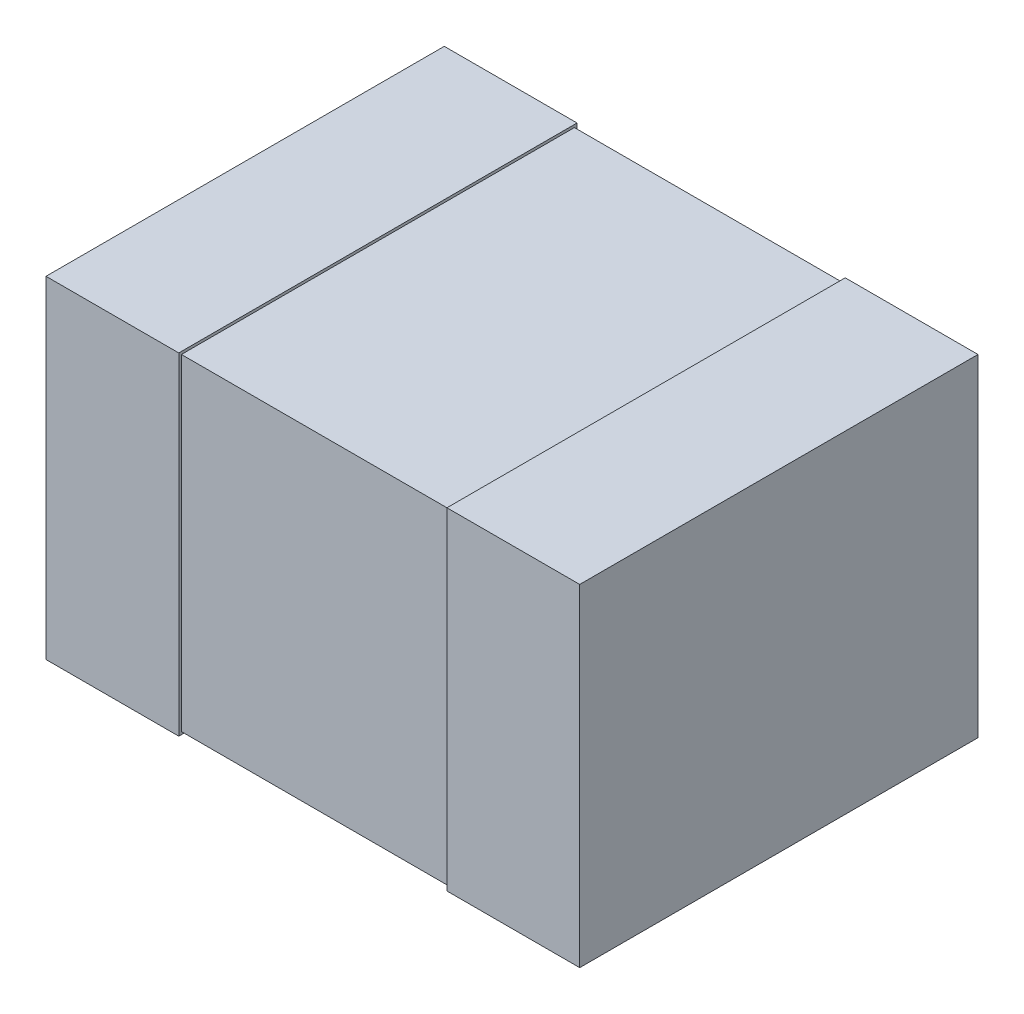
ISO-10303-21;
HEADER;
FILE_DESCRIPTION(('STEP AP214'),'2;1');
FILE_NAME('part.step','',(''),(''),'','','');
FILE_SCHEMA(('AUTOMOTIVE_DESIGN { 1 0 10303 214 1 1 1 1 }'));
ENDSEC;
DATA;
#1=APPLICATION_CONTEXT('core data for automotive mechanical design processes');
#2=APPLICATION_PROTOCOL_DEFINITION('international standard','automotive_design',2000,#1);
#3=PRODUCT_CONTEXT('',#1,'mechanical');
#4=PRODUCT('Part','Part','',(#3));
#5=PRODUCT_RELATED_PRODUCT_CATEGORY('part','',(#4));
#6=PRODUCT_DEFINITION_FORMATION('','',#4);
#7=PRODUCT_DEFINITION_CONTEXT('part definition',#1,'design');
#8=PRODUCT_DEFINITION('design','',#6,#7);
#9=PRODUCT_DEFINITION_SHAPE('','',#8);
#10=(LENGTH_UNIT() NAMED_UNIT(*) SI_UNIT(.MILLI.,.METRE.));
#11=(NAMED_UNIT(*) PLANE_ANGLE_UNIT() SI_UNIT($,.RADIAN.));
#12=(NAMED_UNIT(*) SI_UNIT($,.STERADIAN.) SOLID_ANGLE_UNIT());
#13=UNCERTAINTY_MEASURE_WITH_UNIT(LENGTH_MEASURE(1.E-05),#10,'distance_accuracy_value','');
#14=(GEOMETRIC_REPRESENTATION_CONTEXT(3) GLOBAL_UNCERTAINTY_ASSIGNED_CONTEXT((#13)) GLOBAL_UNIT_ASSIGNED_CONTEXT((#10,
#11,#12)) REPRESENTATION_CONTEXT('',''));
#15=CARTESIAN_POINT('',(0.,0.,0.));
#16=DIRECTION('',(0.,0.,1.));
#17=DIRECTION('',(1.,0.,0.));
#18=AXIS2_PLACEMENT_3D('',#15,#16,#17);
#19=CARTESIAN_POINT('',(1.005,-0.625,0.0762));
#20=DIRECTION('',(1.,0.,0.));
#21=DIRECTION('',(0.,0.,-1.));
#22=AXIS2_PLACEMENT_3D('',#19,#20,#21);
#23=PLANE('',#22);
#24=DIRECTION('',(0.,0.,-1.));
#25=VECTOR('',#24,1.);
#26=CARTESIAN_POINT('',(1.005,-0.625,0.0762));
#27=LINE('',#26,#25);
#28=CARTESIAN_POINT('',(1.005,-0.625,0.0762));
#29=VERTEX_POINT('',#28);
#30=CARTESIAN_POINT('',(1.005,-0.625,1.5762));
#31=VERTEX_POINT('',#30);
#32=EDGE_CURVE('E109',#29,#31,#27,.F.);
#33=ORIENTED_EDGE('',*,*,#32,.F.);
#34=DIRECTION('',(0.,1.,0.));
#35=VECTOR('',#34,1.);
#36=CARTESIAN_POINT('',(1.005,0.,0.0762));
#37=LINE('',#36,#35);
#38=CARTESIAN_POINT('',(1.005,0.625,0.0762));
#39=VERTEX_POINT('',#38);
#40=EDGE_CURVE('E20',#29,#39,#37,.T.);
#41=ORIENTED_EDGE('',*,*,#40,.T.);
#42=DIRECTION('',(0.,0.,1.));
#43=VECTOR('',#42,1.);
#44=CARTESIAN_POINT('',(1.005,0.625,0.0762));
#45=LINE('',#44,#43);
#46=CARTESIAN_POINT('',(1.005,0.625,1.5762));
#47=VERTEX_POINT('',#46);
#48=EDGE_CURVE('E104',#47,#39,#45,.F.);
#49=ORIENTED_EDGE('',*,*,#48,.F.);
#50=DIRECTION('',(0.,1.,0.));
#51=VECTOR('',#50,1.);
#52=CARTESIAN_POINT('',(1.005,0.,1.5762));
#53=LINE('',#52,#51);
#54=EDGE_CURVE('E119',#31,#47,#53,.T.);
#55=ORIENTED_EDGE('',*,*,#54,.F.);
#56=EDGE_LOOP('',(#33,#41,#49,#55));
#57=FACE_BOUND('',#56,.T.);
#58=ADVANCED_FACE('F17',(#57),#23,.T.);
#59=CARTESIAN_POINT('',(0.,0.,0.0762));
#60=DIRECTION('',(0.,0.,1.));
#61=DIRECTION('',(1.,0.,0.));
#62=AXIS2_PLACEMENT_3D('',#59,#60,#61);
#63=PLANE('',#62);
#64=ORIENTED_EDGE('',*,*,#40,.F.);
#65=DIRECTION('',(1.,0.,0.));
#66=VECTOR('',#65,1.);
#67=CARTESIAN_POINT('',(-1.005,-0.625,0.0762));
#68=LINE('',#67,#66);
#69=CARTESIAN_POINT('',(0.505,-0.625,0.0762));
#70=VERTEX_POINT('',#69);
#71=EDGE_CURVE('E128',#70,#29,#68,.T.);
#72=ORIENTED_EDGE('',*,*,#71,.F.);
#73=DIRECTION('',(0.,1.,0.));
#74=VECTOR('',#73,1.);
#75=CARTESIAN_POINT('',(0.505,-0.625,0.0762));
#76=LINE('',#75,#74);
#77=CARTESIAN_POINT('',(0.505,0.625,0.0762));
#78=VERTEX_POINT('',#77);
#79=EDGE_CURVE('E116',#70,#78,#76,.T.);
#80=ORIENTED_EDGE('',*,*,#79,.T.);
#81=DIRECTION('',(1.,0.,0.));
#82=VECTOR('',#81,1.);
#83=CARTESIAN_POINT('',(1.005,0.625,0.0762));
#84=LINE('',#83,#82);
#85=EDGE_CURVE('E113',#39,#78,#84,.F.);
#86=ORIENTED_EDGE('',*,*,#85,.F.);
#87=EDGE_LOOP('',(#64,#72,#80,#86));
#88=FACE_BOUND('',#87,.T.);
#89=ADVANCED_FACE('F114',(#88),#63,.F.);
#90=CARTESIAN_POINT('',(1.005,0.625,0.0762));
#91=DIRECTION('',(0.,1.,0.));
#92=DIRECTION('',(0.,0.,1.));
#93=AXIS2_PLACEMENT_3D('',#90,#91,#92);
#94=PLANE('',#93);
#95=ORIENTED_EDGE('',*,*,#85,.T.);
#96=DIRECTION('',(0.,0.,-1.));
#97=VECTOR('',#96,1.);
#98=CARTESIAN_POINT('',(0.505,0.625,0.0862));
#99=LINE('',#98,#97);
#100=CARTESIAN_POINT('',(0.505,0.625,1.5762));
#101=VERTEX_POINT('',#100);
#102=EDGE_CURVE('E135',#78,#101,#99,.F.);
#103=ORIENTED_EDGE('',*,*,#102,.T.);
#104=DIRECTION('',(1.,0.,0.));
#105=VECTOR('',#104,1.);
#106=CARTESIAN_POINT('',(0.,0.625,1.5762));
#107=LINE('',#106,#105);
#108=EDGE_CURVE('E123',#47,#101,#107,.F.);
#109=ORIENTED_EDGE('',*,*,#108,.F.);
#110=ORIENTED_EDGE('',*,*,#48,.T.);
#111=EDGE_LOOP('',(#95,#103,#109,#110));
#112=FACE_BOUND('',#111,.T.);
#113=ADVANCED_FACE('F121',(#112),#94,.T.);
#114=CARTESIAN_POINT('',(0.,0.,1.5762));
#115=DIRECTION('',(0.,0.,1.));
#116=DIRECTION('',(1.,0.,0.));
#117=AXIS2_PLACEMENT_3D('',#114,#115,#116);
#118=PLANE('',#117);
#119=ORIENTED_EDGE('',*,*,#108,.T.);
#120=DIRECTION('',(0.,1.,0.));
#121=VECTOR('',#120,1.);
#122=CARTESIAN_POINT('',(0.505,-0.625,1.5762));
#123=LINE('',#122,#121);
#124=CARTESIAN_POINT('',(0.505,-0.625,1.5762));
#125=VERTEX_POINT('',#124);
#126=EDGE_CURVE('E137',#101,#125,#123,.F.);
#127=ORIENTED_EDGE('',*,*,#126,.T.);
#128=DIRECTION('',(1.,0.,0.));
#129=VECTOR('',#128,1.);
#130=CARTESIAN_POINT('',(-1.005,-0.625,1.5762));
#131=LINE('',#130,#129);
#132=EDGE_CURVE('E131',#31,#125,#131,.F.);
#133=ORIENTED_EDGE('',*,*,#132,.F.);
#134=ORIENTED_EDGE('',*,*,#54,.T.);
#135=EDGE_LOOP('',(#119,#127,#133,#134));
#136=FACE_BOUND('',#135,.T.);
#137=ADVANCED_FACE('F324',(#136),#118,.T.);
#138=CARTESIAN_POINT('',(-1.005,-0.625,0.0762));
#139=DIRECTION('',(0.,-1.,0.));
#140=DIRECTION('',(0.,0.,-1.));
#141=AXIS2_PLACEMENT_3D('',#138,#139,#140);
#142=PLANE('',#141);
#143=ORIENTED_EDGE('',*,*,#132,.T.);
#144=DIRECTION('',(0.,0.,-1.));
#145=VECTOR('',#144,1.);
#146=CARTESIAN_POINT('',(0.505,-0.625,0.0862));
#147=LINE('',#146,#145);
#148=EDGE_CURVE('E139',#125,#70,#147,.T.);
#149=ORIENTED_EDGE('',*,*,#148,.T.);
#150=ORIENTED_EDGE('',*,*,#71,.T.);
#151=ORIENTED_EDGE('',*,*,#32,.T.);
#152=EDGE_LOOP('',(#143,#149,#150,#151));
#153=FACE_BOUND('',#152,.T.);
#154=ADVANCED_FACE('F315',(#153),#142,.T.);
#155=CARTESIAN_POINT('',(0.505,-0.625,0.0862));
#156=DIRECTION('',(1.,0.,0.));
#157=DIRECTION('',(0.,0.,-1.));
#158=AXIS2_PLACEMENT_3D('',#155,#156,#157);
#159=PLANE('',#158);
#160=DIRECTION('',(0.,1.,0.));
#161=VECTOR('',#160,1.);
#162=CARTESIAN_POINT('',(0.505,0.625,1.5662));
#163=LINE('',#162,#161);
#164=CARTESIAN_POINT('',(0.505,0.615,1.5662));
#165=VERTEX_POINT('',#164);
#166=CARTESIAN_POINT('',(0.505,-0.615,1.5662));
#167=VERTEX_POINT('',#166);
#168=EDGE_CURVE('E157',#165,#167,#163,.F.);
#169=ORIENTED_EDGE('',*,*,#168,.T.);
#170=DIRECTION('',(0.,0.,1.));
#171=VECTOR('',#170,1.);
#172=CARTESIAN_POINT('',(0.505,-0.615,1.5762));
#173=LINE('',#172,#171);
#174=CARTESIAN_POINT('',(0.505,-0.615,0.0862));
#175=VERTEX_POINT('',#174);
#176=EDGE_CURVE('E142',#167,#175,#173,.F.);
#177=ORIENTED_EDGE('',*,*,#176,.T.);
#178=DIRECTION('',(0.,1.,0.));
#179=VECTOR('',#178,1.);
#180=CARTESIAN_POINT('',(0.505,-0.625,0.0862));
#181=LINE('',#180,#179);
#182=CARTESIAN_POINT('',(0.505,0.615,0.0862));
#183=VERTEX_POINT('',#182);
#184=EDGE_CURVE('E147',#175,#183,#181,.T.);
#185=ORIENTED_EDGE('',*,*,#184,.T.);
#186=DIRECTION('',(0.,0.,-1.));
#187=VECTOR('',#186,1.);
#188=CARTESIAN_POINT('',(0.505,0.615,0.0762));
#189=LINE('',#188,#187);
#190=EDGE_CURVE('E152',#183,#165,#189,.F.);
#191=ORIENTED_EDGE('',*,*,#190,.T.);
#192=EDGE_LOOP('',(#169,#177,#185,#191));
#193=FACE_BOUND('',#192,.T.);
#194=ORIENTED_EDGE('',*,*,#126,.F.);
#195=ORIENTED_EDGE('',*,*,#102,.F.);
#196=ORIENTED_EDGE('',*,*,#79,.F.);
#197=ORIENTED_EDGE('',*,*,#148,.F.);
#198=EDGE_LOOP('',(#194,#195,#196,#197));
#199=FACE_BOUND('',#198,.T.);
#200=ADVANCED_FACE('F305',(#193,#199),#159,.F.);
#201=CARTESIAN_POINT('',(-0.505,-0.615,1.5762));
#202=DIRECTION('',(0.,1.,0.));
#203=DIRECTION('',(0.,0.,1.));
#204=AXIS2_PLACEMENT_3D('',#201,#202,#203);
#205=PLANE('',#204);
#206=DIRECTION('',(1.,0.,0.));
#207=VECTOR('',#206,1.);
#208=CARTESIAN_POINT('',(-0.505,-0.615,0.0862));
#209=LINE('',#208,#207);
#210=CARTESIAN_POINT('',(-0.505,-0.615,0.0862));
#211=VERTEX_POINT('',#210);
#212=EDGE_CURVE('E144',#211,#175,#209,.T.);
#213=ORIENTED_EDGE('',*,*,#212,.T.);
#214=ORIENTED_EDGE('',*,*,#176,.F.);
#215=DIRECTION('',(-1.,0.,0.));
#216=VECTOR('',#215,1.);
#217=CARTESIAN_POINT('',(-0.505,-0.615,1.5662));
#218=LINE('',#217,#216);
#219=CARTESIAN_POINT('',(-0.505,-0.615,1.5662));
#220=VERTEX_POINT('',#219);
#221=EDGE_CURVE('E159',#167,#220,#218,.T.);
#222=ORIENTED_EDGE('',*,*,#221,.T.);
#223=DIRECTION('',(0.,0.,1.));
#224=VECTOR('',#223,1.);
#225=CARTESIAN_POINT('',(-0.505,-0.615,0.0762));
#226=LINE('',#225,#224);
#227=EDGE_CURVE('E161',#220,#211,#226,.F.);
#228=ORIENTED_EDGE('',*,*,#227,.T.);
#229=EDGE_LOOP('',(#213,#214,#222,#228));
#230=FACE_BOUND('',#229,.T.);
#231=ADVANCED_FACE('F295',(#230),#205,.F.);
#232=CARTESIAN_POINT('',(-0.505,-0.625,0.0862));
#233=DIRECTION('',(0.,0.,1.));
#234=DIRECTION('',(1.,0.,0.));
#235=AXIS2_PLACEMENT_3D('',#232,#233,#234);
#236=PLANE('',#235);
#237=DIRECTION('',(1.,0.,0.));
#238=VECTOR('',#237,1.);
#239=CARTESIAN_POINT('',(-0.505,0.615,0.0862));
#240=LINE('',#239,#238);
#241=CARTESIAN_POINT('',(-0.505,0.615,0.0862));
#242=VERTEX_POINT('',#241);
#243=EDGE_CURVE('E149',#242,#183,#240,.T.);
#244=ORIENTED_EDGE('',*,*,#243,.T.);
#245=ORIENTED_EDGE('',*,*,#184,.F.);
#246=ORIENTED_EDGE('',*,*,#212,.F.);
#247=DIRECTION('',(0.,1.,0.));
#248=VECTOR('',#247,1.);
#249=CARTESIAN_POINT('',(-0.505,-0.625,0.0862));
#250=LINE('',#249,#248);
#251=EDGE_CURVE('E163',#211,#242,#250,.T.);
#252=ORIENTED_EDGE('',*,*,#251,.T.);
#253=EDGE_LOOP('',(#244,#245,#246,#252));
#254=FACE_BOUND('',#253,.T.);
#255=ADVANCED_FACE('F285',(#254),#236,.F.);
#256=CARTESIAN_POINT('',(-0.505,0.615,0.0762));
#257=DIRECTION('',(0.,-1.,0.));
#258=DIRECTION('',(0.,0.,-1.));
#259=AXIS2_PLACEMENT_3D('',#256,#257,#258);
#260=PLANE('',#259);
#261=DIRECTION('',(-1.,0.,0.));
#262=VECTOR('',#261,1.);
#263=CARTESIAN_POINT('',(-0.505,0.615,1.5662));
#264=LINE('',#263,#262);
#265=CARTESIAN_POINT('',(-0.505,0.615,1.5662));
#266=VERTEX_POINT('',#265);
#267=EDGE_CURVE('E154',#266,#165,#264,.F.);
#268=ORIENTED_EDGE('',*,*,#267,.T.);
#269=ORIENTED_EDGE('',*,*,#190,.F.);
#270=ORIENTED_EDGE('',*,*,#243,.F.);
#271=DIRECTION('',(0.,0.,1.));
#272=VECTOR('',#271,1.);
#273=CARTESIAN_POINT('',(-0.505,0.615,0.0762));
#274=LINE('',#273,#272);
#275=EDGE_CURVE('E165',#242,#266,#274,.T.);
#276=ORIENTED_EDGE('',*,*,#275,.T.);
#277=EDGE_LOOP('',(#268,#269,#270,#276));
#278=FACE_BOUND('',#277,.T.);
#279=ADVANCED_FACE('F275',(#278),#260,.F.);
#280=CARTESIAN_POINT('',(-0.505,0.625,1.5662));
#281=DIRECTION('',(0.,0.,-1.));
#282=DIRECTION('',(-1.,0.,0.));
#283=AXIS2_PLACEMENT_3D('',#280,#281,#282);
#284=PLANE('',#283);
#285=ORIENTED_EDGE('',*,*,#221,.F.);
#286=ORIENTED_EDGE('',*,*,#168,.F.);
#287=ORIENTED_EDGE('',*,*,#267,.F.);
#288=DIRECTION('',(0.,1.,0.));
#289=VECTOR('',#288,1.);
#290=CARTESIAN_POINT('',(-0.505,-0.625,1.5662));
#291=LINE('',#290,#289);
#292=EDGE_CURVE('E167',#266,#220,#291,.F.);
#293=ORIENTED_EDGE('',*,*,#292,.T.);
#294=EDGE_LOOP('',(#285,#286,#287,#293));
#295=FACE_BOUND('',#294,.T.);
#296=ADVANCED_FACE('F219',(#295),#284,.F.);
#297=CARTESIAN_POINT('',(-0.505,-0.625,0.0762));
#298=DIRECTION('',(-1.,0.,0.));
#299=DIRECTION('',(0.,0.,1.));
#300=AXIS2_PLACEMENT_3D('',#297,#298,#299);
#301=PLANE('',#300);
#302=ORIENTED_EDGE('',*,*,#275,.F.);
#303=ORIENTED_EDGE('',*,*,#251,.F.);
#304=ORIENTED_EDGE('',*,*,#227,.F.);
#305=ORIENTED_EDGE('',*,*,#292,.F.);
#306=EDGE_LOOP('',(#302,#303,#304,#305));
#307=FACE_BOUND('',#306,.T.);
#308=DIRECTION('',(0.,1.,0.));
#309=VECTOR('',#308,1.);
#310=CARTESIAN_POINT('',(-0.505,0.,1.5762));
#311=LINE('',#310,#309);
#312=CARTESIAN_POINT('',(-0.505,-0.625,1.5762));
#313=VERTEX_POINT('',#312);
#314=CARTESIAN_POINT('',(-0.505,0.625,1.5762));
#315=VERTEX_POINT('',#314);
#316=EDGE_CURVE('E175',#313,#315,#311,.T.);
#317=ORIENTED_EDGE('',*,*,#316,.F.);
#318=DIRECTION('',(0.,0.,-1.));
#319=VECTOR('',#318,1.);
#320=CARTESIAN_POINT('',(-0.505,-0.625,0.0762));
#321=LINE('',#320,#319);
#322=CARTESIAN_POINT('',(-0.505,-0.625,0.0762));
#323=VERTEX_POINT('',#322);
#324=EDGE_CURVE('E170',#323,#313,#321,.F.);
#325=ORIENTED_EDGE('',*,*,#324,.F.);
#326=DIRECTION('',(0.,1.,0.));
#327=VECTOR('',#326,1.);
#328=CARTESIAN_POINT('',(-0.505,0.,0.0762));
#329=LINE('',#328,#327);
#330=CARTESIAN_POINT('',(-0.505,0.625,0.0762));
#331=VERTEX_POINT('',#330);
#332=EDGE_CURVE('E182',#323,#331,#329,.T.);
#333=ORIENTED_EDGE('',*,*,#332,.T.);
#334=DIRECTION('',(0.,0.,1.));
#335=VECTOR('',#334,1.);
#336=CARTESIAN_POINT('',(-0.505,0.625,0.0762));
#337=LINE('',#336,#335);
#338=EDGE_CURVE('E180',#315,#331,#337,.F.);
#339=ORIENTED_EDGE('',*,*,#338,.F.);
#340=EDGE_LOOP('',(#317,#325,#333,#339));
#341=FACE_BOUND('',#340,.T.);
#342=ADVANCED_FACE('F204',(#307,#341),#301,.F.);
#343=CARTESIAN_POINT('',(-1.005,-0.625,0.0762));
#344=DIRECTION('',(0.,-1.,0.));
#345=DIRECTION('',(0.,0.,-1.));
#346=AXIS2_PLACEMENT_3D('',#343,#344,#345);
#347=PLANE('',#346);
#348=DIRECTION('',(1.,0.,0.));
#349=VECTOR('',#348,1.);
#350=CARTESIAN_POINT('',(0.,-0.625,0.0762));
#351=LINE('',#350,#349);
#352=CARTESIAN_POINT('',(-1.005,-0.625,0.0762));
#353=VERTEX_POINT('',#352);
#354=EDGE_CURVE('E185',#353,#323,#351,.T.);
#355=ORIENTED_EDGE('',*,*,#354,.T.);
#356=ORIENTED_EDGE('',*,*,#324,.T.);
#357=DIRECTION('',(1.,0.,0.));
#358=VECTOR('',#357,1.);
#359=CARTESIAN_POINT('',(0.,-0.625,1.5762));
#360=LINE('',#359,#358);
#361=CARTESIAN_POINT('',(-1.005,-0.625,1.5762));
#362=VERTEX_POINT('',#361);
#363=EDGE_CURVE('E172',#362,#313,#360,.T.);
#364=ORIENTED_EDGE('',*,*,#363,.F.);
#365=DIRECTION('',(0.,0.,1.));
#366=VECTOR('',#365,1.);
#367=CARTESIAN_POINT('',(-1.005,-0.625,0.0762));
#368=LINE('',#367,#366);
#369=EDGE_CURVE('E188',#353,#362,#368,.T.);
#370=ORIENTED_EDGE('',*,*,#369,.F.);
#371=EDGE_LOOP('',(#355,#356,#364,#370));
#372=FACE_BOUND('',#371,.T.);
#373=ADVANCED_FACE('F210',(#372),#347,.T.);
#374=CARTESIAN_POINT('',(0.,0.,1.5762));
#375=DIRECTION('',(0.,0.,1.));
#376=DIRECTION('',(1.,0.,0.));
#377=AXIS2_PLACEMENT_3D('',#374,#375,#376);
#378=PLANE('',#377);
#379=ORIENTED_EDGE('',*,*,#363,.T.);
#380=ORIENTED_EDGE('',*,*,#316,.T.);
#381=DIRECTION('',(1.,0.,0.));
#382=VECTOR('',#381,1.);
#383=CARTESIAN_POINT('',(1.005,0.625,1.5762));
#384=LINE('',#383,#382);
#385=CARTESIAN_POINT('',(-1.005,0.625,1.5762));
#386=VERTEX_POINT('',#385);
#387=EDGE_CURVE('E177',#386,#315,#384,.T.);
#388=ORIENTED_EDGE('',*,*,#387,.F.);
#389=DIRECTION('',(0.,1.,0.));
#390=VECTOR('',#389,1.);
#391=CARTESIAN_POINT('',(-1.005,0.625,1.5762));
#392=LINE('',#391,#390);
#393=EDGE_CURVE('E191',#362,#386,#392,.T.);
#394=ORIENTED_EDGE('',*,*,#393,.F.);
#395=EDGE_LOOP('',(#379,#380,#388,#394));
#396=FACE_BOUND('',#395,.T.);
#397=ADVANCED_FACE('F201',(#396),#378,.T.);
#398=CARTESIAN_POINT('',(1.005,0.625,0.0762));
#399=DIRECTION('',(0.,1.,0.));
#400=DIRECTION('',(0.,0.,1.));
#401=AXIS2_PLACEMENT_3D('',#398,#399,#400);
#402=PLANE('',#401);
#403=ORIENTED_EDGE('',*,*,#387,.T.);
#404=ORIENTED_EDGE('',*,*,#338,.T.);
#405=DIRECTION('',(1.,0.,0.));
#406=VECTOR('',#405,1.);
#407=CARTESIAN_POINT('',(0.,0.625,0.0762));
#408=LINE('',#407,#406);
#409=CARTESIAN_POINT('',(-1.005,0.625,0.0762));
#410=VERTEX_POINT('',#409);
#411=EDGE_CURVE('E35',#331,#410,#408,.F.);
#412=ORIENTED_EDGE('',*,*,#411,.T.);
#413=DIRECTION('',(0.,0.,1.));
#414=VECTOR('',#413,1.);
#415=CARTESIAN_POINT('',(-1.005,0.625,0.0762));
#416=LINE('',#415,#414);
#417=EDGE_CURVE('E26',#386,#410,#416,.F.);
#418=ORIENTED_EDGE('',*,*,#417,.F.);
#419=EDGE_LOOP('',(#403,#404,#412,#418));
#420=FACE_BOUND('',#419,.T.);
#421=ADVANCED_FACE('F198',(#420),#402,.T.);
#422=CARTESIAN_POINT('',(0.,0.,0.0762));
#423=DIRECTION('',(0.,0.,1.));
#424=DIRECTION('',(1.,0.,0.));
#425=AXIS2_PLACEMENT_3D('',#422,#423,#424);
#426=PLANE('',#425);
#427=DIRECTION('',(0.,1.,0.));
#428=VECTOR('',#427,1.);
#429=CARTESIAN_POINT('',(-1.005,0.625,0.0762));
#430=LINE('',#429,#428);
#431=EDGE_CURVE('E11',#410,#353,#430,.F.);
#432=ORIENTED_EDGE('',*,*,#431,.F.);
#433=ORIENTED_EDGE('',*,*,#411,.F.);
#434=ORIENTED_EDGE('',*,*,#332,.F.);
#435=ORIENTED_EDGE('',*,*,#354,.F.);
#436=EDGE_LOOP('',(#432,#433,#434,#435));
#437=FACE_BOUND('',#436,.T.);
#438=ADVANCED_FACE('F208',(#437),#426,.F.);
#439=CARTESIAN_POINT('',(-1.005,0.625,0.0762));
#440=DIRECTION('',(-1.,0.,0.));
#441=DIRECTION('',(0.,0.,1.));
#442=AXIS2_PLACEMENT_3D('',#439,#440,#441);
#443=PLANE('',#442);
#444=ORIENTED_EDGE('',*,*,#417,.T.);
#445=ORIENTED_EDGE('',*,*,#431,.T.);
#446=ORIENTED_EDGE('',*,*,#369,.T.);
#447=ORIENTED_EDGE('',*,*,#393,.T.);
#448=EDGE_LOOP('',(#444,#445,#446,#447));
#449=FACE_BOUND('',#448,.T.);
#450=ADVANCED_FACE('F196',(#449),#443,.T.);
#451=CLOSED_SHELL('',(#58,#89,#113,#137,#154,#200,#231,#255,#279,#296,#342,#373,#397,#421,#438,#450));
#452=MANIFOLD_SOLID_BREP('B1',#451);
#453=ADVANCED_BREP_SHAPE_REPRESENTATION('',(#18,#452),#14);
#454=SHAPE_DEFINITION_REPRESENTATION(#9,#453);
ENDSEC;
END-ISO-10303-21;
